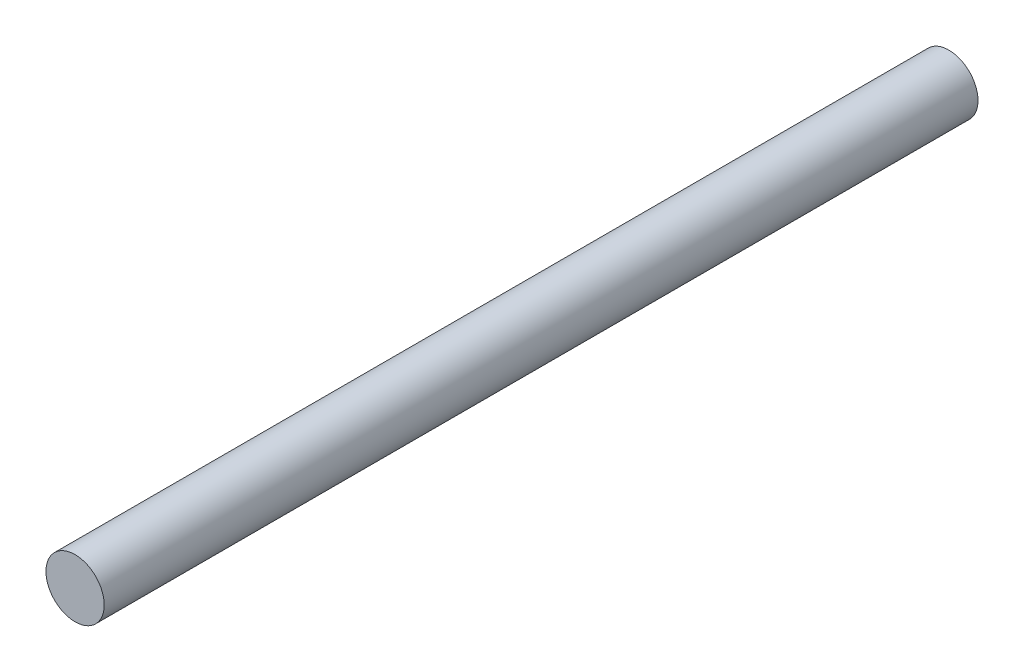
ISO-10303-21;
HEADER;
FILE_DESCRIPTION(('STEP AP214'),'2;1');
FILE_NAME('part.step','',(''),(''),'','','');
FILE_SCHEMA(('AUTOMOTIVE_DESIGN { 1 0 10303 214 1 1 1 1 }'));
ENDSEC;
DATA;
#1=APPLICATION_CONTEXT('core data for automotive mechanical design processes');
#2=APPLICATION_PROTOCOL_DEFINITION('international standard','automotive_design',2000,#1);
#3=PRODUCT_CONTEXT('',#1,'mechanical');
#4=PRODUCT('Part','Part','',(#3));
#5=PRODUCT_RELATED_PRODUCT_CATEGORY('part','',(#4));
#6=PRODUCT_DEFINITION_FORMATION('','',#4);
#7=PRODUCT_DEFINITION_CONTEXT('part definition',#1,'design');
#8=PRODUCT_DEFINITION('design','',#6,#7);
#9=PRODUCT_DEFINITION_SHAPE('','',#8);
#10=(LENGTH_UNIT() NAMED_UNIT(*) SI_UNIT(.MILLI.,.METRE.));
#11=(NAMED_UNIT(*) PLANE_ANGLE_UNIT() SI_UNIT($,.RADIAN.));
#12=(NAMED_UNIT(*) SI_UNIT($,.STERADIAN.) SOLID_ANGLE_UNIT());
#13=UNCERTAINTY_MEASURE_WITH_UNIT(LENGTH_MEASURE(1.E-05),#10,'distance_accuracy_value','');
#14=(GEOMETRIC_REPRESENTATION_CONTEXT(3) GLOBAL_UNCERTAINTY_ASSIGNED_CONTEXT((#13)) GLOBAL_UNIT_ASSIGNED_CONTEXT((#10,
#11,#12)) REPRESENTATION_CONTEXT('',''));
#15=CARTESIAN_POINT('',(0.,0.,0.));
#16=DIRECTION('',(0.,0.,1.));
#17=DIRECTION('',(1.,0.,0.));
#18=AXIS2_PLACEMENT_3D('',#15,#16,#17);
#19=CARTESIAN_POINT('',(0.,10.6109443065967,30.));
#20=DIRECTION('',(0.,0.,-1.));
#21=DIRECTION('',(-1.,0.,0.));
#22=AXIS2_PLACEMENT_3D('',#19,#20,#21);
#23=CYLINDRICAL_SURFACE('',#22,1.);
#24=CARTESIAN_POINT('',(0.,10.6109443065967,30.));
#25=DIRECTION('',(0.,0.,1.));
#26=DIRECTION('',(1.,0.,0.));
#27=AXIS2_PLACEMENT_3D('',#24,#25,#26);
#28=CIRCLE('',#27,1.);
#29=CARTESIAN_POINT('',(1.,10.6109443065967,30.));
#30=VERTEX_POINT('',#29);
#31=EDGE_CURVE('E10',#30,#30,#28,.T.);
#32=ORIENTED_EDGE('',*,*,#31,.F.);
#33=EDGE_LOOP('',(#32));
#34=FACE_BOUND('',#33,.T.);
#35=CARTESIAN_POINT('',(0.,10.6109443065967,0.));
#36=DIRECTION('',(0.,0.,1.));
#37=DIRECTION('',(1.,0.,0.));
#38=AXIS2_PLACEMENT_3D('',#35,#36,#37);
#39=CIRCLE('',#38,1.);
#40=CARTESIAN_POINT('',(1.,10.6109443065967,0.));
#41=VERTEX_POINT('',#40);
#42=EDGE_CURVE('E36',#41,#41,#39,.T.);
#43=ORIENTED_EDGE('',*,*,#42,.T.);
#44=EDGE_LOOP('',(#43));
#45=FACE_BOUND('',#44,.T.);
#46=ADVANCED_FACE('F33',(#34,#45),#23,.T.);
#47=CARTESIAN_POINT('',(0.,10.6109443065967,30.));
#48=DIRECTION('',(0.,0.,1.));
#49=DIRECTION('',(1.,0.,0.));
#50=AXIS2_PLACEMENT_3D('',#47,#48,#49);
#51=PLANE('',#50);
#52=ORIENTED_EDGE('',*,*,#31,.T.);
#53=EDGE_LOOP('',(#52));
#54=FACE_BOUND('',#53,.T.);
#55=ADVANCED_FACE('F48',(#54),#51,.T.);
#56=CARTESIAN_POINT('',(0.,10.6109443065967,0.));
#57=DIRECTION('',(0.,0.,1.));
#58=DIRECTION('',(1.,0.,0.));
#59=AXIS2_PLACEMENT_3D('',#56,#57,#58);
#60=PLANE('',#59);
#61=ORIENTED_EDGE('',*,*,#42,.F.);
#62=EDGE_LOOP('',(#61));
#63=FACE_BOUND('',#62,.T.);
#64=ADVANCED_FACE('F46',(#63),#60,.F.);
#65=CLOSED_SHELL('',(#46,#55,#64));
#66=MANIFOLD_SOLID_BREP('B2',#65);
#67=ADVANCED_BREP_SHAPE_REPRESENTATION('',(#18,#66),#14);
#68=SHAPE_DEFINITION_REPRESENTATION(#9,#67);
ENDSEC;
END-ISO-10303-21;
